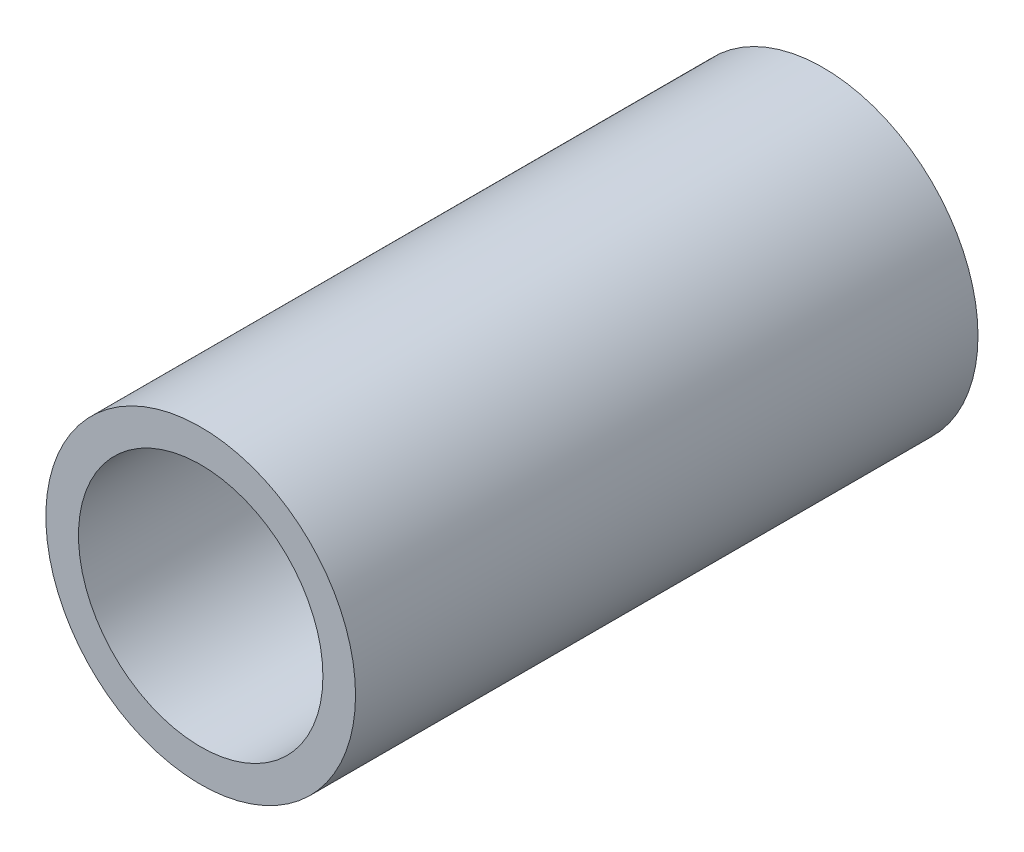
ISO-10303-21;
HEADER;
FILE_DESCRIPTION(('STEP AP214'),'2;1');
FILE_NAME('part.step','',(''),(''),'','','');
FILE_SCHEMA(('AUTOMOTIVE_DESIGN { 1 0 10303 214 1 1 1 1 }'));
ENDSEC;
DATA;
#1=APPLICATION_CONTEXT('core data for automotive mechanical design processes');
#2=APPLICATION_PROTOCOL_DEFINITION('international standard','automotive_design',2000,#1);
#3=PRODUCT_CONTEXT('',#1,'mechanical');
#4=PRODUCT('Part','Part','',(#3));
#5=PRODUCT_RELATED_PRODUCT_CATEGORY('part','',(#4));
#6=PRODUCT_DEFINITION_FORMATION('','',#4);
#7=PRODUCT_DEFINITION_CONTEXT('part definition',#1,'design');
#8=PRODUCT_DEFINITION('design','',#6,#7);
#9=PRODUCT_DEFINITION_SHAPE('','',#8);
#10=(LENGTH_UNIT() NAMED_UNIT(*) SI_UNIT(.MILLI.,.METRE.));
#11=(NAMED_UNIT(*) PLANE_ANGLE_UNIT() SI_UNIT($,.RADIAN.));
#12=(NAMED_UNIT(*) SI_UNIT($,.STERADIAN.) SOLID_ANGLE_UNIT());
#13=UNCERTAINTY_MEASURE_WITH_UNIT(LENGTH_MEASURE(1.E-05),#10,'distance_accuracy_value','');
#14=(GEOMETRIC_REPRESENTATION_CONTEXT(3) GLOBAL_UNCERTAINTY_ASSIGNED_CONTEXT((#13)) GLOBAL_UNIT_ASSIGNED_CONTEXT((#10,
#11,#12)) REPRESENTATION_CONTEXT('',''));
#15=CARTESIAN_POINT('',(0.,0.,0.));
#16=DIRECTION('',(0.,0.,1.));
#17=DIRECTION('',(1.,0.,0.));
#18=AXIS2_PLACEMENT_3D('',#15,#16,#17);
#19=CARTESIAN_POINT('',(0.,0.,-0.254));
#20=DIRECTION('',(0.,0.,1.));
#21=DIRECTION('',(1.,0.,0.));
#22=AXIS2_PLACEMENT_3D('',#19,#20,#21);
#23=CYLINDRICAL_SURFACE('',#22,12.7);
#24=CARTESIAN_POINT('',(0.,0.,-0.254));
#25=DIRECTION('',(0.,0.,1.));
#26=DIRECTION('',(1.,0.,0.));
#27=AXIS2_PLACEMENT_3D('',#24,#25,#26);
#28=CIRCLE('',#27,12.7);
#29=CARTESIAN_POINT('',(12.7,0.,-0.254));
#30=VERTEX_POINT('',#29);
#31=EDGE_CURVE('E10',#30,#30,#28,.T.);
#32=ORIENTED_EDGE('',*,*,#31,.T.);
#33=EDGE_LOOP('',(#32));
#34=FACE_BOUND('',#33,.T.);
#35=CARTESIAN_POINT('',(0.,0.,50.8));
#36=DIRECTION('',(0.,0.,1.));
#37=DIRECTION('',(1.,0.,0.));
#38=AXIS2_PLACEMENT_3D('',#35,#36,#37);
#39=CIRCLE('',#38,12.7);
#40=CARTESIAN_POINT('',(12.7,0.,50.8));
#41=VERTEX_POINT('',#40);
#42=EDGE_CURVE('E54',#41,#41,#39,.T.);
#43=ORIENTED_EDGE('',*,*,#42,.F.);
#44=EDGE_LOOP('',(#43));
#45=FACE_BOUND('',#44,.T.);
#46=ADVANCED_FACE('F42',(#34,#45),#23,.T.);
#47=CARTESIAN_POINT('',(0.,0.,-0.254));
#48=DIRECTION('',(0.,0.,1.));
#49=DIRECTION('',(1.,0.,0.));
#50=AXIS2_PLACEMENT_3D('',#47,#48,#49);
#51=PLANE('',#50);
#52=CARTESIAN_POINT('',(0.,0.,-0.254));
#53=DIRECTION('',(0.,0.,1.));
#54=DIRECTION('',(1.,0.,0.));
#55=AXIS2_PLACEMENT_3D('',#52,#53,#54);
#56=CIRCLE('',#55,10.025);
#57=CARTESIAN_POINT('',(10.025,0.,-0.254));
#58=VERTEX_POINT('',#57);
#59=EDGE_CURVE('E49',#58,#58,#56,.T.);
#60=ORIENTED_EDGE('',*,*,#59,.T.);
#61=EDGE_LOOP('',(#60));
#62=FACE_BOUND('',#61,.T.);
#63=ORIENTED_EDGE('',*,*,#31,.F.);
#64=EDGE_LOOP('',(#63));
#65=FACE_BOUND('',#64,.T.);
#66=ADVANCED_FACE('F75',(#62,#65),#51,.F.);
#67=CARTESIAN_POINT('',(0.,0.,-0.254));
#68=DIRECTION('',(0.,0.,1.));
#69=DIRECTION('',(1.,0.,0.));
#70=AXIS2_PLACEMENT_3D('',#67,#68,#69);
#71=CYLINDRICAL_SURFACE('',#70,10.025);
#72=ORIENTED_EDGE('',*,*,#59,.F.);
#73=EDGE_LOOP('',(#72));
#74=FACE_BOUND('',#73,.T.);
#75=CARTESIAN_POINT('',(0.,0.,50.8));
#76=DIRECTION('',(0.,0.,1.));
#77=DIRECTION('',(1.,0.,0.));
#78=AXIS2_PLACEMENT_3D('',#75,#76,#77);
#79=CIRCLE('',#78,10.025);
#80=CARTESIAN_POINT('',(10.025,0.,50.8));
#81=VERTEX_POINT('',#80);
#82=EDGE_CURVE('E59',#81,#81,#79,.T.);
#83=ORIENTED_EDGE('',*,*,#82,.T.);
#84=EDGE_LOOP('',(#83));
#85=FACE_BOUND('',#84,.T.);
#86=ADVANCED_FACE('F66',(#74,#85),#71,.F.);
#87=CARTESIAN_POINT('',(0.,0.,50.8));
#88=DIRECTION('',(0.,0.,1.));
#89=DIRECTION('',(1.,0.,0.));
#90=AXIS2_PLACEMENT_3D('',#87,#88,#89);
#91=PLANE('',#90);
#92=ORIENTED_EDGE('',*,*,#42,.T.);
#93=EDGE_LOOP('',(#92));
#94=FACE_BOUND('',#93,.T.);
#95=ORIENTED_EDGE('',*,*,#82,.F.);
#96=EDGE_LOOP('',(#95));
#97=FACE_BOUND('',#96,.T.);
#98=ADVANCED_FACE('F68',(#94,#97),#91,.T.);
#99=CLOSED_SHELL('',(#46,#66,#86,#98));
#100=MANIFOLD_SOLID_BREP('B2',#99);
#101=ADVANCED_BREP_SHAPE_REPRESENTATION('',(#18,#100),#14);
#102=SHAPE_DEFINITION_REPRESENTATION(#9,#101);
ENDSEC;
END-ISO-10303-21;
